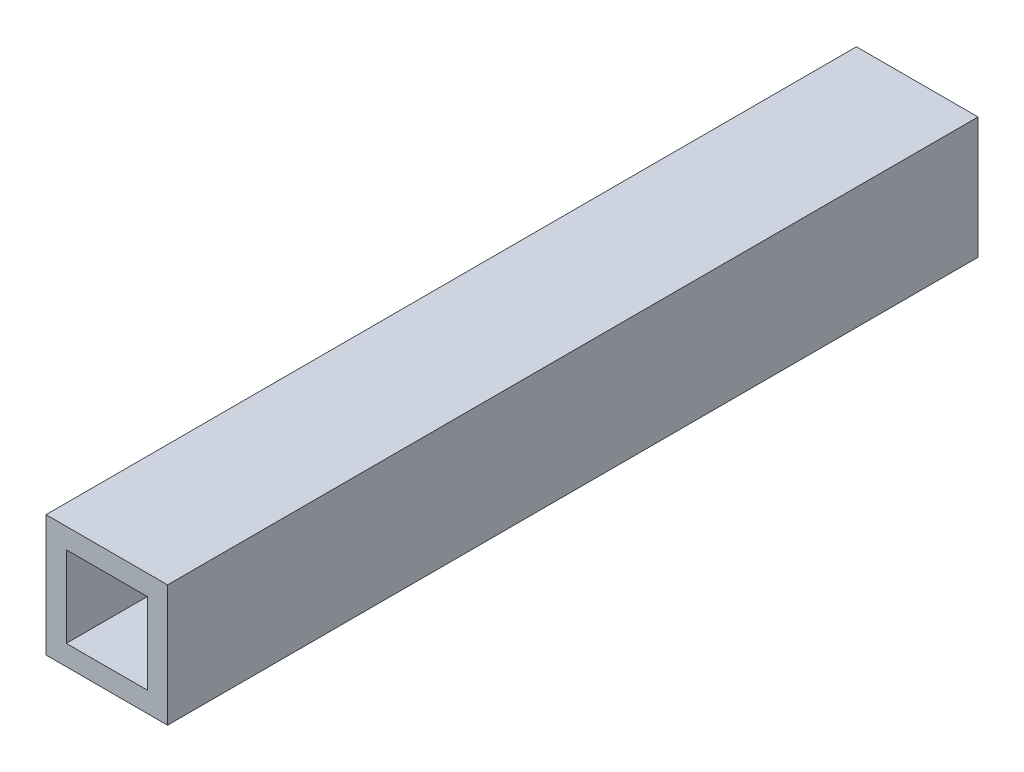
ISO-10303-21;
HEADER;
FILE_DESCRIPTION(('STEP AP214'),'2;1');
FILE_NAME('part.step','',(''),(''),'','','');
FILE_SCHEMA(('AUTOMOTIVE_DESIGN { 1 0 10303 214 1 1 1 1 }'));
ENDSEC;
DATA;
#1=APPLICATION_CONTEXT('core data for automotive mechanical design processes');
#2=APPLICATION_PROTOCOL_DEFINITION('international standard','automotive_design',2000,#1);
#3=PRODUCT_CONTEXT('',#1,'mechanical');
#4=PRODUCT('Part','Part','',(#3));
#5=PRODUCT_RELATED_PRODUCT_CATEGORY('part','',(#4));
#6=PRODUCT_DEFINITION_FORMATION('','',#4);
#7=PRODUCT_DEFINITION_CONTEXT('part definition',#1,'design');
#8=PRODUCT_DEFINITION('design','',#6,#7);
#9=PRODUCT_DEFINITION_SHAPE('','',#8);
#10=(LENGTH_UNIT() NAMED_UNIT(*) SI_UNIT(.MILLI.,.METRE.));
#11=(NAMED_UNIT(*) PLANE_ANGLE_UNIT() SI_UNIT($,.RADIAN.));
#12=(NAMED_UNIT(*) SI_UNIT($,.STERADIAN.) SOLID_ANGLE_UNIT());
#13=UNCERTAINTY_MEASURE_WITH_UNIT(LENGTH_MEASURE(1.E-05),#10,'distance_accuracy_value','');
#14=(GEOMETRIC_REPRESENTATION_CONTEXT(3) GLOBAL_UNCERTAINTY_ASSIGNED_CONTEXT((#13)) GLOBAL_UNIT_ASSIGNED_CONTEXT((#10,
#11,#12)) REPRESENTATION_CONTEXT('',''));
#15=CARTESIAN_POINT('',(0.,0.,0.));
#16=DIRECTION('',(0.,0.,1.));
#17=DIRECTION('',(1.,0.,0.));
#18=AXIS2_PLACEMENT_3D('',#15,#16,#17);
#19=CARTESIAN_POINT('',(9.52500000000001,-9.52499999999999,-127.));
#20=DIRECTION('',(1.,0.,0.));
#21=DIRECTION('',(0.,0.,-1.));
#22=AXIS2_PLACEMENT_3D('',#19,#20,#21);
#23=PLANE('',#22);
#24=DIRECTION('',(0.,1.,0.));
#25=VECTOR('',#24,1.);
#26=CARTESIAN_POINT('',(9.52500000000001,-9.52499999999999,0.));
#27=LINE('',#26,#25);
#28=CARTESIAN_POINT('',(9.52500000000001,-9.52499999999999,0.));
#29=VERTEX_POINT('',#28);
#30=CARTESIAN_POINT('',(9.52500000000001,9.52500000000001,0.));
#31=VERTEX_POINT('',#30);
#32=EDGE_CURVE('E112',#29,#31,#27,.T.);
#33=ORIENTED_EDGE('',*,*,#32,.F.);
#34=DIRECTION('',(0.,0.,1.));
#35=VECTOR('',#34,1.);
#36=CARTESIAN_POINT('',(9.52500000000001,-9.52499999999999,-127.));
#37=LINE('',#36,#35);
#38=CARTESIAN_POINT('',(9.52500000000001,-9.52499999999999,-127.));
#39=VERTEX_POINT('',#38);
#40=EDGE_CURVE('E11',#39,#29,#37,.T.);
#41=ORIENTED_EDGE('',*,*,#40,.F.);
#42=DIRECTION('',(0.,1.,0.));
#43=VECTOR('',#42,1.);
#44=CARTESIAN_POINT('',(9.52500000000001,-9.52499999999999,-127.));
#45=LINE('',#44,#43);
#46=CARTESIAN_POINT('',(9.52500000000001,9.52500000000001,-127.));
#47=VERTEX_POINT('',#46);
#48=EDGE_CURVE('E151',#39,#47,#45,.T.);
#49=ORIENTED_EDGE('',*,*,#48,.T.);
#50=DIRECTION('',(0.,0.,1.));
#51=VECTOR('',#50,1.);
#52=CARTESIAN_POINT('',(9.52500000000001,9.52500000000001,-127.));
#53=LINE('',#52,#51);
#54=EDGE_CURVE('E42',#47,#31,#53,.T.);
#55=ORIENTED_EDGE('',*,*,#54,.T.);
#56=EDGE_LOOP('',(#33,#41,#49,#55));
#57=FACE_BOUND('',#56,.T.);
#58=ADVANCED_FACE('F39',(#57),#23,.T.);
#59=CARTESIAN_POINT('',(-9.525,-9.52499999999999,-127.));
#60=DIRECTION('',(0.,-1.,0.));
#61=DIRECTION('',(0.,0.,-1.));
#62=AXIS2_PLACEMENT_3D('',#59,#60,#61);
#63=PLANE('',#62);
#64=DIRECTION('',(1.,0.,0.));
#65=VECTOR('',#64,1.);
#66=CARTESIAN_POINT('',(-9.525,-9.52499999999999,0.));
#67=LINE('',#66,#65);
#68=CARTESIAN_POINT('',(-9.525,-9.52499999999999,0.));
#69=VERTEX_POINT('',#68);
#70=EDGE_CURVE('E156',#69,#29,#67,.T.);
#71=ORIENTED_EDGE('',*,*,#70,.F.);
#72=DIRECTION('',(0.,0.,1.));
#73=VECTOR('',#72,1.);
#74=CARTESIAN_POINT('',(-9.525,-9.52499999999999,-127.));
#75=LINE('',#74,#73);
#76=CARTESIAN_POINT('',(-9.525,-9.52499999999999,-127.));
#77=VERTEX_POINT('',#76);
#78=EDGE_CURVE('E48',#77,#69,#75,.T.);
#79=ORIENTED_EDGE('',*,*,#78,.F.);
#80=DIRECTION('',(1.,0.,0.));
#81=VECTOR('',#80,1.);
#82=CARTESIAN_POINT('',(-9.525,-9.52499999999999,-127.));
#83=LINE('',#82,#81);
#84=EDGE_CURVE('E164',#77,#39,#83,.T.);
#85=ORIENTED_EDGE('',*,*,#84,.T.);
#86=ORIENTED_EDGE('',*,*,#40,.T.);
#87=EDGE_LOOP('',(#71,#79,#85,#86));
#88=FACE_BOUND('',#87,.T.);
#89=ADVANCED_FACE('F198',(#88),#63,.T.);
#90=CARTESIAN_POINT('',(-9.525,-9.52499999999999,-127.));
#91=DIRECTION('',(-1.,0.,0.));
#92=DIRECTION('',(0.,0.,1.));
#93=AXIS2_PLACEMENT_3D('',#90,#91,#92);
#94=PLANE('',#93);
#95=DIRECTION('',(0.,-1.,0.));
#96=VECTOR('',#95,1.);
#97=CARTESIAN_POINT('',(-9.525,-9.52499999999999,0.));
#98=LINE('',#97,#96);
#99=CARTESIAN_POINT('',(-9.525,9.52500000000001,0.));
#100=VERTEX_POINT('',#99);
#101=EDGE_CURVE('E175',#100,#69,#98,.T.);
#102=ORIENTED_EDGE('',*,*,#101,.F.);
#103=DIRECTION('',(0.,0.,1.));
#104=VECTOR('',#103,1.);
#105=CARTESIAN_POINT('',(-9.525,9.52500000000001,-127.));
#106=LINE('',#105,#104);
#107=CARTESIAN_POINT('',(-9.525,9.52500000000001,-127.));
#108=VERTEX_POINT('',#107);
#109=EDGE_CURVE('E183',#108,#100,#106,.T.);
#110=ORIENTED_EDGE('',*,*,#109,.F.);
#111=DIRECTION('',(0.,-1.,0.));
#112=VECTOR('',#111,1.);
#113=CARTESIAN_POINT('',(-9.525,-9.52499999999999,-127.));
#114=LINE('',#113,#112);
#115=EDGE_CURVE('E160',#108,#77,#114,.T.);
#116=ORIENTED_EDGE('',*,*,#115,.T.);
#117=ORIENTED_EDGE('',*,*,#78,.T.);
#118=EDGE_LOOP('',(#102,#110,#116,#117));
#119=FACE_BOUND('',#118,.T.);
#120=ADVANCED_FACE('F202',(#119),#94,.T.);
#121=CARTESIAN_POINT('',(-9.525,9.52500000000001,-127.));
#122=DIRECTION('',(0.,1.,0.));
#123=DIRECTION('',(0.,0.,1.));
#124=AXIS2_PLACEMENT_3D('',#121,#122,#123);
#125=PLANE('',#124);
#126=DIRECTION('',(-1.,0.,0.));
#127=VECTOR('',#126,1.);
#128=CARTESIAN_POINT('',(-9.525,9.52500000000001,0.));
#129=LINE('',#128,#127);
#130=EDGE_CURVE('E171',#31,#100,#129,.T.);
#131=ORIENTED_EDGE('',*,*,#130,.F.);
#132=ORIENTED_EDGE('',*,*,#54,.F.);
#133=DIRECTION('',(-1.,0.,0.));
#134=VECTOR('',#133,1.);
#135=CARTESIAN_POINT('',(-9.525,9.52500000000001,-127.));
#136=LINE('',#135,#134);
#137=EDGE_CURVE('E155',#47,#108,#136,.T.);
#138=ORIENTED_EDGE('',*,*,#137,.T.);
#139=ORIENTED_EDGE('',*,*,#109,.T.);
#140=EDGE_LOOP('',(#131,#132,#138,#139));
#141=FACE_BOUND('',#140,.T.);
#142=ADVANCED_FACE('F193',(#141),#125,.T.);
#143=CARTESIAN_POINT('',(0.,0.,-127.));
#144=DIRECTION('',(0.,0.,-1.));
#145=DIRECTION('',(-1.,0.,0.));
#146=AXIS2_PLACEMENT_3D('',#143,#144,#145);
#147=PLANE('',#146);
#148=DIRECTION('',(0.,1.,0.));
#149=VECTOR('',#148,1.);
#150=CARTESIAN_POINT('',(6.35,-6.35,-127.));
#151=LINE('',#150,#149);
#152=CARTESIAN_POINT('',(6.35,-6.35,-127.));
#153=VERTEX_POINT('',#152);
#154=CARTESIAN_POINT('',(6.35,6.35,-127.));
#155=VERTEX_POINT('',#154);
#156=EDGE_CURVE('E116',#153,#155,#151,.T.);
#157=ORIENTED_EDGE('',*,*,#156,.T.);
#158=DIRECTION('',(-1.,0.,0.));
#159=VECTOR('',#158,1.);
#160=CARTESIAN_POINT('',(-6.35,6.35,-127.));
#161=LINE('',#160,#159);
#162=CARTESIAN_POINT('',(-6.35,6.35,-127.));
#163=VERTEX_POINT('',#162);
#164=EDGE_CURVE('E104',#155,#163,#161,.T.);
#165=ORIENTED_EDGE('',*,*,#164,.T.);
#166=DIRECTION('',(0.,-1.,0.));
#167=VECTOR('',#166,1.);
#168=CARTESIAN_POINT('',(-6.35,-6.35,-127.));
#169=LINE('',#168,#167);
#170=CARTESIAN_POINT('',(-6.35,-6.35,-127.));
#171=VERTEX_POINT('',#170);
#172=EDGE_CURVE('E131',#163,#171,#169,.T.);
#173=ORIENTED_EDGE('',*,*,#172,.T.);
#174=DIRECTION('',(1.,0.,0.));
#175=VECTOR('',#174,1.);
#176=CARTESIAN_POINT('',(-6.35,-6.35,-127.));
#177=LINE('',#176,#175);
#178=EDGE_CURVE('E124',#171,#153,#177,.T.);
#179=ORIENTED_EDGE('',*,*,#178,.T.);
#180=EDGE_LOOP('',(#157,#165,#173,#179));
#181=FACE_BOUND('',#180,.T.);
#182=ORIENTED_EDGE('',*,*,#48,.F.);
#183=ORIENTED_EDGE('',*,*,#84,.F.);
#184=ORIENTED_EDGE('',*,*,#115,.F.);
#185=ORIENTED_EDGE('',*,*,#137,.F.);
#186=EDGE_LOOP('',(#182,#183,#184,#185));
#187=FACE_BOUND('',#186,.T.);
#188=ADVANCED_FACE('F122',(#181,#187),#147,.T.);
#189=CARTESIAN_POINT('',(0.,0.,0.));
#190=DIRECTION('',(0.,0.,-1.));
#191=DIRECTION('',(-1.,0.,0.));
#192=AXIS2_PLACEMENT_3D('',#189,#190,#191);
#193=PLANE('',#192);
#194=DIRECTION('',(-1.,0.,0.));
#195=VECTOR('',#194,1.);
#196=CARTESIAN_POINT('',(-6.35,6.35,0.));
#197=LINE('',#196,#195);
#198=CARTESIAN_POINT('',(6.35,6.35,0.));
#199=VERTEX_POINT('',#198);
#200=CARTESIAN_POINT('',(-6.35,6.35,0.));
#201=VERTEX_POINT('',#200);
#202=EDGE_CURVE('E129',#199,#201,#197,.T.);
#203=ORIENTED_EDGE('',*,*,#202,.F.);
#204=DIRECTION('',(0.,1.,0.));
#205=VECTOR('',#204,1.);
#206=CARTESIAN_POINT('',(6.35,-6.35,0.));
#207=LINE('',#206,#205);
#208=CARTESIAN_POINT('',(6.35,-6.35,0.));
#209=VERTEX_POINT('',#208);
#210=EDGE_CURVE('E64',#209,#199,#207,.T.);
#211=ORIENTED_EDGE('',*,*,#210,.F.);
#212=DIRECTION('',(1.,0.,0.));
#213=VECTOR('',#212,1.);
#214=CARTESIAN_POINT('',(-6.35,-6.35,0.));
#215=LINE('',#214,#213);
#216=CARTESIAN_POINT('',(-6.35,-6.35,0.));
#217=VERTEX_POINT('',#216);
#218=EDGE_CURVE('E119',#217,#209,#215,.T.);
#219=ORIENTED_EDGE('',*,*,#218,.F.);
#220=DIRECTION('',(0.,-1.,0.));
#221=VECTOR('',#220,1.);
#222=CARTESIAN_POINT('',(-6.35,-6.35,0.));
#223=LINE('',#222,#221);
#224=EDGE_CURVE('E137',#201,#217,#223,.T.);
#225=ORIENTED_EDGE('',*,*,#224,.F.);
#226=EDGE_LOOP('',(#203,#211,#219,#225));
#227=FACE_BOUND('',#226,.T.);
#228=ORIENTED_EDGE('',*,*,#32,.T.);
#229=ORIENTED_EDGE('',*,*,#130,.T.);
#230=ORIENTED_EDGE('',*,*,#101,.T.);
#231=ORIENTED_EDGE('',*,*,#70,.T.);
#232=EDGE_LOOP('',(#228,#229,#230,#231));
#233=FACE_BOUND('',#232,.T.);
#234=ADVANCED_FACE('F195',(#227,#233),#193,.F.);
#235=CARTESIAN_POINT('',(6.35,-6.35,-127.001));
#236=DIRECTION('',(1.,0.,0.));
#237=DIRECTION('',(0.,0.,-1.));
#238=AXIS2_PLACEMENT_3D('',#235,#236,#237);
#239=PLANE('',#238);
#240=DIRECTION('',(0.,0.,1.));
#241=VECTOR('',#240,1.);
#242=CARTESIAN_POINT('',(6.35,-6.35,-127.001));
#243=LINE('',#242,#241);
#244=EDGE_CURVE('E113',#153,#209,#243,.T.);
#245=ORIENTED_EDGE('',*,*,#244,.T.);
#246=ORIENTED_EDGE('',*,*,#210,.T.);
#247=DIRECTION('',(0.,0.,1.));
#248=VECTOR('',#247,1.);
#249=CARTESIAN_POINT('',(6.35,6.35,-127.001));
#250=LINE('',#249,#248);
#251=EDGE_CURVE('E106',#155,#199,#250,.T.);
#252=ORIENTED_EDGE('',*,*,#251,.F.);
#253=ORIENTED_EDGE('',*,*,#156,.F.);
#254=EDGE_LOOP('',(#245,#246,#252,#253));
#255=FACE_BOUND('',#254,.T.);
#256=ADVANCED_FACE('F115',(#255),#239,.F.);
#257=CARTESIAN_POINT('',(-6.35,-6.35,-127.001));
#258=DIRECTION('',(0.,-1.,0.));
#259=DIRECTION('',(0.,0.,-1.));
#260=AXIS2_PLACEMENT_3D('',#257,#258,#259);
#261=PLANE('',#260);
#262=DIRECTION('',(0.,0.,1.));
#263=VECTOR('',#262,1.);
#264=CARTESIAN_POINT('',(-6.35,-6.35,-127.001));
#265=LINE('',#264,#263);
#266=EDGE_CURVE('E146',#171,#217,#265,.T.);
#267=ORIENTED_EDGE('',*,*,#266,.T.);
#268=ORIENTED_EDGE('',*,*,#218,.T.);
#269=ORIENTED_EDGE('',*,*,#244,.F.);
#270=ORIENTED_EDGE('',*,*,#178,.F.);
#271=EDGE_LOOP('',(#267,#268,#269,#270));
#272=FACE_BOUND('',#271,.T.);
#273=ADVANCED_FACE('F253',(#272),#261,.F.);
#274=CARTESIAN_POINT('',(-6.35,-6.35,-127.001));
#275=DIRECTION('',(-1.,0.,0.));
#276=DIRECTION('',(0.,0.,1.));
#277=AXIS2_PLACEMENT_3D('',#274,#275,#276);
#278=PLANE('',#277);
#279=DIRECTION('',(0.,0.,1.));
#280=VECTOR('',#279,1.);
#281=CARTESIAN_POINT('',(-6.35,6.35,-127.001));
#282=LINE('',#281,#280);
#283=EDGE_CURVE('E56',#163,#201,#282,.T.);
#284=ORIENTED_EDGE('',*,*,#283,.T.);
#285=ORIENTED_EDGE('',*,*,#224,.T.);
#286=ORIENTED_EDGE('',*,*,#266,.F.);
#287=ORIENTED_EDGE('',*,*,#172,.F.);
#288=EDGE_LOOP('',(#284,#285,#286,#287));
#289=FACE_BOUND('',#288,.T.);
#290=ADVANCED_FACE('F262',(#289),#278,.F.);
#291=CARTESIAN_POINT('',(-6.35,6.35,-127.001));
#292=DIRECTION('',(0.,1.,0.));
#293=DIRECTION('',(0.,0.,1.));
#294=AXIS2_PLACEMENT_3D('',#291,#292,#293);
#295=PLANE('',#294);
#296=ORIENTED_EDGE('',*,*,#251,.T.);
#297=ORIENTED_EDGE('',*,*,#202,.T.);
#298=ORIENTED_EDGE('',*,*,#283,.F.);
#299=ORIENTED_EDGE('',*,*,#164,.F.);
#300=EDGE_LOOP('',(#296,#297,#298,#299));
#301=FACE_BOUND('',#300,.T.);
#302=ADVANCED_FACE('F105',(#301),#295,.F.);
#303=CLOSED_SHELL('',(#58,#89,#120,#142,#188,#234,#256,#273,#290,#302));
#304=MANIFOLD_SOLID_BREP('B2',#303);
#305=ADVANCED_BREP_SHAPE_REPRESENTATION('',(#18,#304),#14);
#306=SHAPE_DEFINITION_REPRESENTATION(#9,#305);
ENDSEC;
END-ISO-10303-21;
